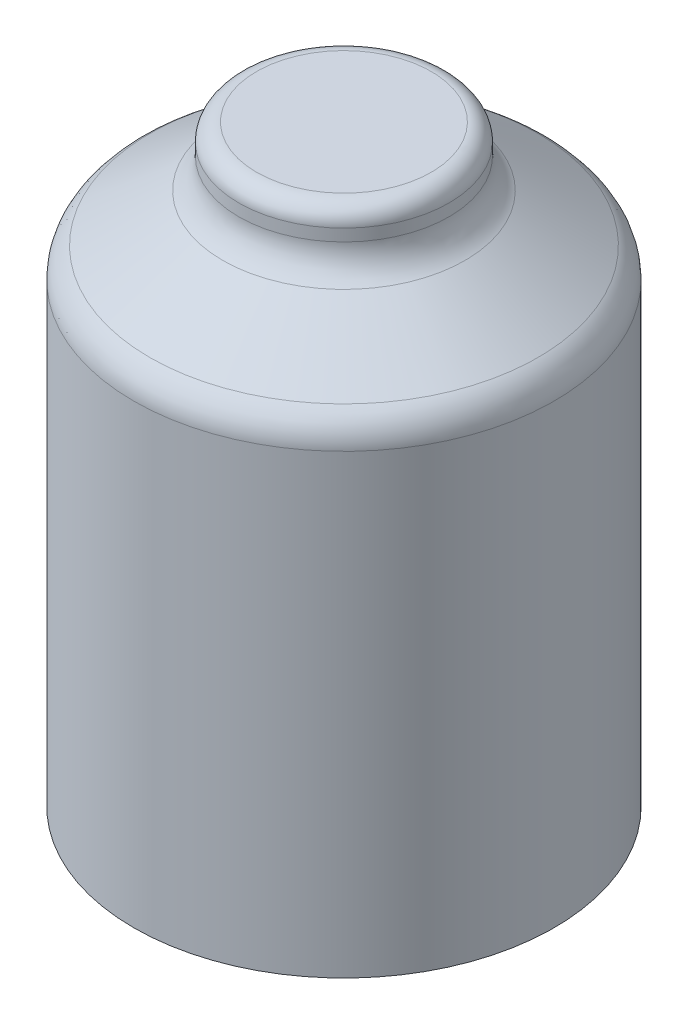
ISO-10303-21;
HEADER;
FILE_DESCRIPTION(('STEP AP214'),'2;1');
FILE_NAME('part.step','',(''),(''),'','','');
FILE_SCHEMA(('AUTOMOTIVE_DESIGN { 1 0 10303 214 1 1 1 1 }'));
ENDSEC;
DATA;
#1=APPLICATION_CONTEXT('core data for automotive mechanical design processes');
#2=APPLICATION_PROTOCOL_DEFINITION('international standard','automotive_design',2000,#1);
#3=PRODUCT_CONTEXT('',#1,'mechanical');
#4=PRODUCT('Part','Part','',(#3));
#5=PRODUCT_RELATED_PRODUCT_CATEGORY('part','',(#4));
#6=PRODUCT_DEFINITION_FORMATION('','',#4);
#7=PRODUCT_DEFINITION_CONTEXT('part definition',#1,'design');
#8=PRODUCT_DEFINITION('design','',#6,#7);
#9=PRODUCT_DEFINITION_SHAPE('','',#8);
#10=(LENGTH_UNIT() NAMED_UNIT(*) SI_UNIT(.MILLI.,.METRE.));
#11=(NAMED_UNIT(*) PLANE_ANGLE_UNIT() SI_UNIT($,.RADIAN.));
#12=(NAMED_UNIT(*) SI_UNIT($,.STERADIAN.) SOLID_ANGLE_UNIT());
#13=UNCERTAINTY_MEASURE_WITH_UNIT(LENGTH_MEASURE(1.E-05),#10,'distance_accuracy_value','');
#14=(GEOMETRIC_REPRESENTATION_CONTEXT(3) GLOBAL_UNCERTAINTY_ASSIGNED_CONTEXT((#13)) GLOBAL_UNIT_ASSIGNED_CONTEXT((#10,
#11,#12)) REPRESENTATION_CONTEXT('',''));
#15=CARTESIAN_POINT('',(0.,0.,0.));
#16=DIRECTION('',(0.,0.,1.));
#17=DIRECTION('',(1.,0.,0.));
#18=AXIS2_PLACEMENT_3D('',#15,#16,#17);
#19=CARTESIAN_POINT('',(4.92336728463388,0.,0.));
#20=DIRECTION('',(0.,-1.,0.));
#21=DIRECTION('',(0.,0.,-1.));
#22=AXIS2_PLACEMENT_3D('',#19,#20,#21);
#23=PLANE('',#22);
#24=CARTESIAN_POINT('',(0.,0.,0.));
#25=DIRECTION('',(0.,1.,0.));
#26=DIRECTION('',(0.,0.,1.));
#27=AXIS2_PLACEMENT_3D('',#24,#25,#26);
#28=CIRCLE('',#27,4.92336728463388);
#29=CARTESIAN_POINT('',(0.,0.,4.92336728463388));
#30=VERTEX_POINT('',#29);
#31=EDGE_CURVE('E74',#30,#30,#28,.T.);
#32=ORIENTED_EDGE('',*,*,#31,.T.);
#33=EDGE_LOOP('',(#32));
#34=FACE_BOUND('',#33,.T.);
#35=ADVANCED_FACE('F43',(#34),#23,.F.);
#36=CARTESIAN_POINT('',(0.,-33.420374519661,0.));
#37=DIRECTION('',(0.,1.,0.));
#38=DIRECTION('',(0.,0.,1.));
#39=AXIS2_PLACEMENT_3D('',#36,#37,#38);
#40=PLANE('',#39);
#41=CARTESIAN_POINT('',(0.,-33.420374519661,0.));
#42=DIRECTION('',(0.,1.,0.));
#43=DIRECTION('',(0.,0.,1.));
#44=AXIS2_PLACEMENT_3D('',#41,#42,#43);
#45=CIRCLE('',#44,11.8467345692678);
#46=CARTESIAN_POINT('',(0.,-33.420374519661,11.8467345692678));
#47=VERTEX_POINT('',#46);
#48=EDGE_CURVE('E10',#47,#47,#45,.T.);
#49=ORIENTED_EDGE('',*,*,#48,.F.);
#50=EDGE_LOOP('',(#49));
#51=FACE_BOUND('',#50,.T.);
#52=ADVANCED_FACE('F111',(#51),#40,.F.);
#53=CARTESIAN_POINT('',(0.,0.,0.));
#54=DIRECTION('',(0.,1.,0.));
#55=DIRECTION('',(0.,0.,1.));
#56=AXIS2_PLACEMENT_3D('',#53,#54,#55);
#57=CYLINDRICAL_SURFACE('',#56,11.8467345692678);
#58=CARTESIAN_POINT('',(0.,-7.7087434386143,0.));
#59=DIRECTION('',(0.,1.,0.));
#60=DIRECTION('',(0.,0.,1.));
#61=AXIS2_PLACEMENT_3D('',#58,#59,#60);
#62=CIRCLE('',#61,11.8467345692678);
#63=CARTESIAN_POINT('',(0.,-7.7087434386143,11.8467345692678));
#64=VERTEX_POINT('',#63);
#65=EDGE_CURVE('E50',#64,#64,#62,.T.);
#66=ORIENTED_EDGE('',*,*,#65,.F.);
#67=EDGE_LOOP('',(#66));
#68=FACE_BOUND('',#67,.T.);
#69=ORIENTED_EDGE('',*,*,#48,.T.);
#70=EDGE_LOOP('',(#69));
#71=FACE_BOUND('',#70,.T.);
#72=ADVANCED_FACE('F106',(#68,#71),#57,.T.);
#73=CARTESIAN_POINT('',(0.,-7.70874343861429,0.));
#74=DIRECTION('',(0.,1.,0.));
#75=DIRECTION('',(0.,0.,1.));
#76=AXIS2_PLACEMENT_3D('',#73,#74,#75);
#77=TOROIDAL_SURFACE('',#76,9.84673456926778,2.);
#78=CARTESIAN_POINT('',(0.,-6.03418452138471,0.));
#79=DIRECTION('',(0.,1.,0.));
#80=DIRECTION('',(0.,0.,1.));
#81=AXIS2_PLACEMENT_3D('',#78,#79,#80);
#82=CIRCLE('',#81,10.9402849488694);
#83=CARTESIAN_POINT('',(0.,-6.03418452138471,10.9402849488694));
#84=VERTEX_POINT('',#83);
#85=EDGE_CURVE('E55',#84,#84,#82,.T.);
#86=ORIENTED_EDGE('',*,*,#85,.F.);
#87=EDGE_LOOP('',(#86));
#88=FACE_BOUND('',#87,.T.);
#89=ORIENTED_EDGE('',*,*,#65,.T.);
#90=EDGE_LOOP('',(#89));
#91=FACE_BOUND('',#90,.T.);
#92=ADVANCED_FACE('F101',(#88,#91),#77,.T.);
#93=CARTESIAN_POINT('',(0.,-6.03418452138471,0.));
#94=DIRECTION('',(0.,-1.,0.));
#95=DIRECTION('',(0.,0.,-1.));
#96=AXIS2_PLACEMENT_3D('',#93,#94,#95);
#97=CONICAL_SURFACE('',#96,10.9402849488694,0.992288488284995);
#98=CARTESIAN_POINT('',(0.,-3.34989324716954,0.));
#99=DIRECTION('',(0.,1.,0.));
#100=DIRECTION('',(0.,0.,1.));
#101=AXIS2_PLACEMENT_3D('',#98,#99,#100);
#102=CIRCLE('',#101,6.82981690503225);
#103=CARTESIAN_POINT('',(0.,-3.34989324716954,6.82981690503225));
#104=VERTEX_POINT('',#103);
#105=EDGE_CURVE('E60',#104,#104,#102,.T.);
#106=ORIENTED_EDGE('',*,*,#105,.F.);
#107=EDGE_LOOP('',(#106));
#108=FACE_BOUND('',#107,.T.);
#109=ORIENTED_EDGE('',*,*,#85,.T.);
#110=EDGE_LOOP('',(#109));
#111=FACE_BOUND('',#110,.T.);
#112=ADVANCED_FACE('F95',(#108,#111),#97,.T.);
#113=CARTESIAN_POINT('',(0.,-1.67533432993996,0.));
#114=DIRECTION('',(0.,1.,0.));
#115=DIRECTION('',(0.,0.,1.));
#116=AXIS2_PLACEMENT_3D('',#113,#114,#115);
#117=TOROIDAL_SURFACE('',#116,7.92336728463389,2.);
#118=CARTESIAN_POINT('',(0.,-1.67533432993996,0.));
#119=DIRECTION('',(0.,1.,0.));
#120=DIRECTION('',(0.,0.,1.));
#121=AXIS2_PLACEMENT_3D('',#118,#119,#120);
#122=CIRCLE('',#121,5.92336728463389);
#123=CARTESIAN_POINT('',(0.,-1.67533432993996,5.92336728463389));
#124=VERTEX_POINT('',#123);
#125=EDGE_CURVE('E66',#124,#124,#122,.T.);
#126=ORIENTED_EDGE('',*,*,#125,.F.);
#127=EDGE_LOOP('',(#126));
#128=FACE_BOUND('',#127,.T.);
#129=ORIENTED_EDGE('',*,*,#105,.T.);
#130=EDGE_LOOP('',(#129));
#131=FACE_BOUND('',#130,.T.);
#132=ADVANCED_FACE('F89',(#128,#131),#117,.F.);
#133=CARTESIAN_POINT('',(0.,0.,0.));
#134=DIRECTION('',(0.,1.,0.));
#135=DIRECTION('',(0.,0.,1.));
#136=AXIS2_PLACEMENT_3D('',#133,#134,#135);
#137=CYLINDRICAL_SURFACE('',#136,5.92336728463389);
#138=CARTESIAN_POINT('',(0.,-1.00000000000001,0.));
#139=DIRECTION('',(0.,1.,0.));
#140=DIRECTION('',(0.,0.,1.));
#141=AXIS2_PLACEMENT_3D('',#138,#139,#140);
#142=CIRCLE('',#141,5.92336728463389);
#143=CARTESIAN_POINT('',(0.,-1.00000000000001,5.92336728463389));
#144=VERTEX_POINT('',#143);
#145=EDGE_CURVE('E70',#144,#144,#142,.T.);
#146=ORIENTED_EDGE('',*,*,#145,.F.);
#147=EDGE_LOOP('',(#146));
#148=FACE_BOUND('',#147,.T.);
#149=ORIENTED_EDGE('',*,*,#125,.T.);
#150=EDGE_LOOP('',(#149));
#151=FACE_BOUND('',#150,.T.);
#152=ADVANCED_FACE('F83',(#148,#151),#137,.T.);
#153=CARTESIAN_POINT('',(0.,-1.,0.));
#154=DIRECTION('',(0.,1.,0.));
#155=DIRECTION('',(0.,0.,1.));
#156=AXIS2_PLACEMENT_3D('',#153,#154,#155);
#157=TOROIDAL_SURFACE('',#156,4.92336728463389,1.);
#158=ORIENTED_EDGE('',*,*,#31,.F.);
#159=EDGE_LOOP('',(#158));
#160=FACE_BOUND('',#159,.T.);
#161=ORIENTED_EDGE('',*,*,#145,.T.);
#162=EDGE_LOOP('',(#161));
#163=FACE_BOUND('',#162,.T.);
#164=ADVANCED_FACE('F80',(#160,#163),#157,.T.);
#165=CLOSED_SHELL('',(#35,#52,#72,#92,#112,#132,#152,#164));
#166=MANIFOLD_SOLID_BREP('B2',#165);
#167=ADVANCED_BREP_SHAPE_REPRESENTATION('',(#18,#166),#14);
#168=SHAPE_DEFINITION_REPRESENTATION(#9,#167);
ENDSEC;
END-ISO-10303-21;
